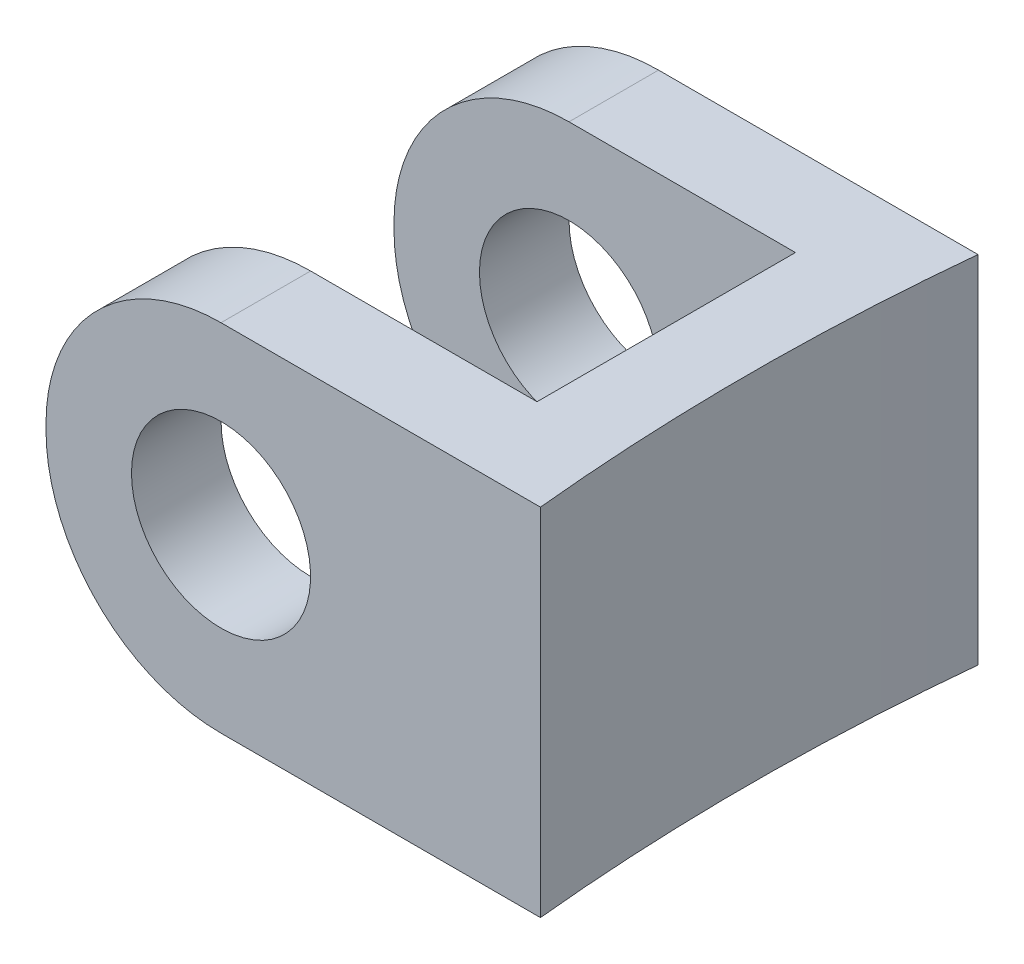
ISO-10303-21;
HEADER;
FILE_DESCRIPTION(('STEP AP214'),'2;1');
FILE_NAME('part.step','',(''),(''),'','','');
FILE_SCHEMA(('AUTOMOTIVE_DESIGN { 1 0 10303 214 1 1 1 1 }'));
ENDSEC;
DATA;
#1=APPLICATION_CONTEXT('core data for automotive mechanical design processes');
#2=APPLICATION_PROTOCOL_DEFINITION('international standard','automotive_design',2000,#1);
#3=PRODUCT_CONTEXT('',#1,'mechanical');
#4=PRODUCT('Part','Part','',(#3));
#5=PRODUCT_RELATED_PRODUCT_CATEGORY('part','',(#4));
#6=PRODUCT_DEFINITION_FORMATION('','',#4);
#7=PRODUCT_DEFINITION_CONTEXT('part definition',#1,'design');
#8=PRODUCT_DEFINITION('design','',#6,#7);
#9=PRODUCT_DEFINITION_SHAPE('','',#8);
#10=(LENGTH_UNIT() NAMED_UNIT(*) SI_UNIT(.MILLI.,.METRE.));
#11=(NAMED_UNIT(*) PLANE_ANGLE_UNIT() SI_UNIT($,.RADIAN.));
#12=(NAMED_UNIT(*) SI_UNIT($,.STERADIAN.) SOLID_ANGLE_UNIT());
#13=UNCERTAINTY_MEASURE_WITH_UNIT(LENGTH_MEASURE(1.E-05),#10,'distance_accuracy_value','');
#14=(GEOMETRIC_REPRESENTATION_CONTEXT(3) GLOBAL_UNCERTAINTY_ASSIGNED_CONTEXT((#13)) GLOBAL_UNIT_ASSIGNED_CONTEXT((#10,
#11,#12)) REPRESENTATION_CONTEXT('',''));
#15=CARTESIAN_POINT('',(0.,0.,0.));
#16=DIRECTION('',(0.,0.,1.));
#17=DIRECTION('',(1.,0.,0.));
#18=AXIS2_PLACEMENT_3D('',#15,#16,#17);
#19=CARTESIAN_POINT('',(0.,8.255,0.));
#20=DIRECTION('',(1.,0.,0.));
#21=DIRECTION('',(0.,0.,-1.));
#22=AXIS2_PLACEMENT_3D('',#19,#20,#21);
#23=PLANE('',#22);
#24=DIRECTION('',(0.,-1.,0.));
#25=VECTOR('',#24,1.);
#26=CARTESIAN_POINT('',(0.,8.255,0.));
#27=LINE('',#26,#25);
#28=CARTESIAN_POINT('',(0.,4.191,0.));
#29=VERTEX_POINT('',#28);
#30=CARTESIAN_POINT('',(0.,4.064,0.));
#31=VERTEX_POINT('',#30);
#32=EDGE_CURVE('E160',#29,#31,#27,.T.);
#33=ORIENTED_EDGE('',*,*,#32,.T.);
#34=DIRECTION('',(0.,0.,1.));
#35=VECTOR('',#34,1.);
#36=CARTESIAN_POINT('',(0.,4.064,0.));
#37=LINE('',#36,#35);
#38=CARTESIAN_POINT('',(0.,4.064,2.07974));
#39=VERTEX_POINT('',#38);
#40=EDGE_CURVE('E211',#31,#39,#37,.T.);
#41=ORIENTED_EDGE('',*,*,#40,.T.);
#42=DIRECTION('',(0.,-1.,0.));
#43=VECTOR('',#42,1.);
#44=CARTESIAN_POINT('',(0.,8.255,2.07974));
#45=LINE('',#44,#43);
#46=CARTESIAN_POINT('',(0.,4.191,2.07974));
#47=VERTEX_POINT('',#46);
#48=EDGE_CURVE('E143',#47,#39,#45,.T.);
#49=ORIENTED_EDGE('',*,*,#48,.F.);
#50=DIRECTION('',(0.,0.,1.));
#51=VECTOR('',#50,1.);
#52=CARTESIAN_POINT('',(0.,4.191,0.));
#53=LINE('',#52,#51);
#54=EDGE_CURVE('E53',#47,#29,#53,.F.);
#55=ORIENTED_EDGE('',*,*,#54,.T.);
#56=EDGE_LOOP('',(#33,#41,#49,#55));
#57=FACE_BOUND('',#56,.T.);
#58=ADVANCED_FACE('F33',(#57),#23,.F.);
#59=CARTESIAN_POINT('',(9.3218,8.255,2.07974));
#60=DIRECTION('',(0.,0.,-1.));
#61=DIRECTION('',(-1.,0.,0.));
#62=AXIS2_PLACEMENT_3D('',#59,#60,#61);
#63=PLANE('',#62);
#64=CARTESIAN_POINT('',(4.064,4.191,2.07974));
#65=DIRECTION('',(0.,0.,-1.));
#66=DIRECTION('',(-1.,0.,0.));
#67=AXIS2_PLACEMENT_3D('',#64,#65,#66);
#68=CIRCLE('',#67,2.07899);
#69=CARTESIAN_POINT('',(1.98501,4.191,2.07974));
#70=VERTEX_POINT('',#69);
#71=EDGE_CURVE('E163',#70,#70,#68,.T.);
#72=ORIENTED_EDGE('',*,*,#71,.T.);
#73=EDGE_LOOP('',(#72));
#74=FACE_BOUND('',#73,.T.);
#75=ORIENTED_EDGE('',*,*,#48,.T.);
#76=CARTESIAN_POINT('',(4.064,4.064,2.07974));
#77=DIRECTION('',(0.,0.,-1.));
#78=DIRECTION('',(-1.,0.,0.));
#79=AXIS2_PLACEMENT_3D('',#76,#77,#78);
#80=CIRCLE('',#79,4.064);
#81=CARTESIAN_POINT('',(4.064,0.,2.07974));
#82=VERTEX_POINT('',#81);
#83=EDGE_CURVE('E216',#39,#82,#80,.F.);
#84=ORIENTED_EDGE('',*,*,#83,.T.);
#85=DIRECTION('',(1.,0.,0.));
#86=VECTOR('',#85,1.);
#87=CARTESIAN_POINT('',(9.3218,0.,2.07974));
#88=LINE('',#87,#86);
#89=CARTESIAN_POINT('',(9.3218,0.,2.07974));
#90=VERTEX_POINT('',#89);
#91=EDGE_CURVE('E140',#82,#90,#88,.T.);
#92=ORIENTED_EDGE('',*,*,#91,.T.);
#93=DIRECTION('',(0.,-1.,0.));
#94=VECTOR('',#93,1.);
#95=CARTESIAN_POINT('',(9.3218,8.255,2.07974));
#96=LINE('',#95,#94);
#97=CARTESIAN_POINT('',(9.3218,8.255,2.07974));
#98=VERTEX_POINT('',#97);
#99=EDGE_CURVE('E136',#98,#90,#96,.T.);
#100=ORIENTED_EDGE('',*,*,#99,.F.);
#101=DIRECTION('',(1.,0.,0.));
#102=VECTOR('',#101,1.);
#103=CARTESIAN_POINT('',(9.3218,8.255,2.07974));
#104=LINE('',#103,#102);
#105=CARTESIAN_POINT('',(4.064,8.255,2.07974));
#106=VERTEX_POINT('',#105);
#107=EDGE_CURVE('E122',#106,#98,#104,.T.);
#108=ORIENTED_EDGE('',*,*,#107,.F.);
#109=CARTESIAN_POINT('',(4.064,4.191,2.07974));
#110=DIRECTION('',(0.,0.,-1.));
#111=DIRECTION('',(-1.,0.,0.));
#112=AXIS2_PLACEMENT_3D('',#109,#110,#111);
#113=CIRCLE('',#112,4.064);
#114=EDGE_CURVE('E214',#106,#47,#113,.F.);
#115=ORIENTED_EDGE('',*,*,#114,.T.);
#116=EDGE_LOOP('',(#75,#84,#92,#100,#108,#115));
#117=FACE_BOUND('',#116,.T.);
#118=ADVANCED_FACE('F138',(#74,#117),#63,.F.);
#119=CARTESIAN_POINT('',(9.3218,8.255,5.08));
#120=DIRECTION('',(1.,0.,0.));
#121=DIRECTION('',(0.,0.,-1.));
#122=AXIS2_PLACEMENT_3D('',#119,#120,#121);
#123=PLANE('',#122);
#124=DIRECTION('',(0.,0.,1.));
#125=VECTOR('',#124,1.);
#126=CARTESIAN_POINT('',(9.3218,0.,5.08));
#127=LINE('',#126,#125);
#128=CARTESIAN_POINT('',(9.3218,0.,8.07974));
#129=VERTEX_POINT('',#128);
#130=EDGE_CURVE('E162',#90,#129,#127,.T.);
#131=ORIENTED_EDGE('',*,*,#130,.T.);
#132=DIRECTION('',(0.,-1.,0.));
#133=VECTOR('',#132,1.);
#134=CARTESIAN_POINT('',(9.3218,8.255,8.07974));
#135=LINE('',#134,#133);
#136=CARTESIAN_POINT('',(9.3218,8.255,8.07974));
#137=VERTEX_POINT('',#136);
#138=EDGE_CURVE('E144',#137,#129,#135,.T.);
#139=ORIENTED_EDGE('',*,*,#138,.F.);
#140=DIRECTION('',(0.,0.,1.));
#141=VECTOR('',#140,1.);
#142=CARTESIAN_POINT('',(9.3218,8.255,5.08));
#143=LINE('',#142,#141);
#144=EDGE_CURVE('E127',#98,#137,#143,.T.);
#145=ORIENTED_EDGE('',*,*,#144,.F.);
#146=ORIENTED_EDGE('',*,*,#99,.T.);
#147=EDGE_LOOP('',(#131,#139,#145,#146));
#148=FACE_BOUND('',#147,.T.);
#149=ADVANCED_FACE('F146',(#148),#123,.F.);
#150=CARTESIAN_POINT('',(9.3218,8.255,8.07974));
#151=DIRECTION('',(0.,0.,1.));
#152=DIRECTION('',(1.,0.,0.));
#153=AXIS2_PLACEMENT_3D('',#150,#151,#152);
#154=PLANE('',#153);
#155=CARTESIAN_POINT('',(4.064,4.191,8.07974));
#156=DIRECTION('',(0.,0.,1.));
#157=DIRECTION('',(1.,0.,0.));
#158=AXIS2_PLACEMENT_3D('',#155,#156,#157);
#159=CIRCLE('',#158,2.07899);
#160=CARTESIAN_POINT('',(6.14299,4.191,8.07974));
#161=VERTEX_POINT('',#160);
#162=EDGE_CURVE('E400',#161,#161,#159,.T.);
#163=ORIENTED_EDGE('',*,*,#162,.T.);
#164=EDGE_LOOP('',(#163));
#165=FACE_BOUND('',#164,.T.);
#166=DIRECTION('',(-1.,0.,0.));
#167=VECTOR('',#166,1.);
#168=CARTESIAN_POINT('',(9.3218,0.,8.07974));
#169=LINE('',#168,#167);
#170=CARTESIAN_POINT('',(4.064,0.,8.07974));
#171=VERTEX_POINT('',#170);
#172=EDGE_CURVE('E165',#129,#171,#169,.T.);
#173=ORIENTED_EDGE('',*,*,#172,.T.);
#174=CARTESIAN_POINT('',(4.064,4.064,8.07974));
#175=DIRECTION('',(0.,0.,1.));
#176=DIRECTION('',(1.,0.,0.));
#177=AXIS2_PLACEMENT_3D('',#174,#175,#176);
#178=CIRCLE('',#177,4.064);
#179=CARTESIAN_POINT('',(0.,4.064,8.07974));
#180=VERTEX_POINT('',#179);
#181=EDGE_CURVE('E204',#171,#180,#178,.F.);
#182=ORIENTED_EDGE('',*,*,#181,.T.);
#183=DIRECTION('',(0.,-1.,0.));
#184=VECTOR('',#183,1.);
#185=CARTESIAN_POINT('',(0.,8.255,8.07974));
#186=LINE('',#185,#184);
#187=CARTESIAN_POINT('',(0.,4.191,8.07974));
#188=VERTEX_POINT('',#187);
#189=EDGE_CURVE('E184',#188,#180,#186,.T.);
#190=ORIENTED_EDGE('',*,*,#189,.F.);
#191=CARTESIAN_POINT('',(4.064,4.191,8.07974));
#192=DIRECTION('',(0.,0.,1.));
#193=DIRECTION('',(1.,0.,0.));
#194=AXIS2_PLACEMENT_3D('',#191,#192,#193);
#195=CIRCLE('',#194,4.064);
#196=CARTESIAN_POINT('',(4.064,8.255,8.07974));
#197=VERTEX_POINT('',#196);
#198=EDGE_CURVE('E202',#188,#197,#195,.F.);
#199=ORIENTED_EDGE('',*,*,#198,.T.);
#200=DIRECTION('',(-1.,0.,0.));
#201=VECTOR('',#200,1.);
#202=CARTESIAN_POINT('',(9.3218,8.255,8.07974));
#203=LINE('',#202,#201);
#204=EDGE_CURVE('E149',#137,#197,#203,.T.);
#205=ORIENTED_EDGE('',*,*,#204,.F.);
#206=ORIENTED_EDGE('',*,*,#138,.T.);
#207=EDGE_LOOP('',(#173,#182,#190,#199,#205,#206));
#208=FACE_BOUND('',#207,.T.);
#209=ADVANCED_FACE('F232',(#165,#208),#154,.F.);
#210=CARTESIAN_POINT('',(0.,8.255,8.07974));
#211=DIRECTION('',(1.,0.,0.));
#212=DIRECTION('',(0.,0.,-1.));
#213=AXIS2_PLACEMENT_3D('',#210,#211,#212);
#214=PLANE('',#213);
#215=ORIENTED_EDGE('',*,*,#189,.T.);
#216=DIRECTION('',(0.,0.,1.));
#217=VECTOR('',#216,1.);
#218=CARTESIAN_POINT('',(0.,4.064,8.07974));
#219=LINE('',#218,#217);
#220=CARTESIAN_POINT('',(0.,4.064,10.16));
#221=VERTEX_POINT('',#220);
#222=EDGE_CURVE('E191',#180,#221,#219,.T.);
#223=ORIENTED_EDGE('',*,*,#222,.T.);
#224=DIRECTION('',(0.,-1.,0.));
#225=VECTOR('',#224,1.);
#226=CARTESIAN_POINT('',(0.,8.255,10.16));
#227=LINE('',#226,#225);
#228=CARTESIAN_POINT('',(0.,4.191,10.16));
#229=VERTEX_POINT('',#228);
#230=EDGE_CURVE('E181',#229,#221,#227,.T.);
#231=ORIENTED_EDGE('',*,*,#230,.F.);
#232=DIRECTION('',(0.,0.,1.));
#233=VECTOR('',#232,1.);
#234=CARTESIAN_POINT('',(0.,4.191,8.07974));
#235=LINE('',#234,#233);
#236=EDGE_CURVE('E189',#229,#188,#235,.F.);
#237=ORIENTED_EDGE('',*,*,#236,.T.);
#238=EDGE_LOOP('',(#215,#223,#231,#237));
#239=FACE_BOUND('',#238,.T.);
#240=ADVANCED_FACE('F246',(#239),#214,.F.);
#241=CARTESIAN_POINT('',(11.2268,8.255,10.16));
#242=DIRECTION('',(0.,0.,-1.));
#243=DIRECTION('',(-1.,0.,0.));
#244=AXIS2_PLACEMENT_3D('',#241,#242,#243);
#245=PLANE('',#244);
#246=CARTESIAN_POINT('',(4.064,4.191,10.16));
#247=DIRECTION('',(0.,0.,-1.));
#248=DIRECTION('',(-1.,0.,0.));
#249=AXIS2_PLACEMENT_3D('',#246,#247,#248);
#250=CIRCLE('',#249,2.07899);
#251=CARTESIAN_POINT('',(1.98501,4.191,10.16));
#252=VERTEX_POINT('',#251);
#253=EDGE_CURVE('E402',#252,#252,#250,.T.);
#254=ORIENTED_EDGE('',*,*,#253,.T.);
#255=EDGE_LOOP('',(#254));
#256=FACE_BOUND('',#255,.T.);
#257=ORIENTED_EDGE('',*,*,#230,.T.);
#258=CARTESIAN_POINT('',(4.064,4.064,10.16));
#259=DIRECTION('',(0.,0.,-1.));
#260=DIRECTION('',(-1.,0.,0.));
#261=AXIS2_PLACEMENT_3D('',#258,#259,#260);
#262=CIRCLE('',#261,4.064);
#263=CARTESIAN_POINT('',(4.064,0.,10.16));
#264=VERTEX_POINT('',#263);
#265=EDGE_CURVE('E196',#221,#264,#262,.F.);
#266=ORIENTED_EDGE('',*,*,#265,.T.);
#267=DIRECTION('',(1.,0.,0.));
#268=VECTOR('',#267,1.);
#269=CARTESIAN_POINT('',(11.2268,0.,10.16));
#270=LINE('',#269,#268);
#271=CARTESIAN_POINT('',(11.4814381949837,0.,10.16));
#272=VERTEX_POINT('',#271);
#273=EDGE_CURVE('E168',#264,#272,#270,.T.);
#274=ORIENTED_EDGE('',*,*,#273,.T.);
#275=DIRECTION('',(0.,-1.,0.));
#276=VECTOR('',#275,1.);
#277=CARTESIAN_POINT('',(11.4814381949837,8.255,10.16));
#278=LINE('',#277,#276);
#279=CARTESIAN_POINT('',(11.4814381949837,8.255,10.16));
#280=VERTEX_POINT('',#279);
#281=EDGE_CURVE('E178',#280,#272,#278,.T.);
#282=ORIENTED_EDGE('',*,*,#281,.F.);
#283=DIRECTION('',(1.,0.,0.));
#284=VECTOR('',#283,1.);
#285=CARTESIAN_POINT('',(0.,8.255,10.16));
#286=LINE('',#285,#284);
#287=CARTESIAN_POINT('',(4.064,8.255,10.16));
#288=VERTEX_POINT('',#287);
#289=EDGE_CURVE('E151',#288,#280,#286,.T.);
#290=ORIENTED_EDGE('',*,*,#289,.F.);
#291=CARTESIAN_POINT('',(4.064,4.191,10.16));
#292=DIRECTION('',(0.,0.,-1.));
#293=DIRECTION('',(-1.,0.,0.));
#294=AXIS2_PLACEMENT_3D('',#291,#292,#293);
#295=CIRCLE('',#294,4.064);
#296=EDGE_CURVE('E194',#288,#229,#295,.F.);
#297=ORIENTED_EDGE('',*,*,#296,.T.);
#298=EDGE_LOOP('',(#257,#266,#274,#282,#290,#297));
#299=FACE_BOUND('',#298,.T.);
#300=ADVANCED_FACE('F243',(#256,#299),#245,.F.);
#301=CARTESIAN_POINT('',(62.0268,8.255,5.08));
#302=DIRECTION('',(0.,-1.,0.));
#303=DIRECTION('',(0.,0.,-1.));
#304=AXIS2_PLACEMENT_3D('',#301,#302,#303);
#305=CYLINDRICAL_SURFACE('',#304,50.8);
#306=CARTESIAN_POINT('',(62.0268,0.,5.08));
#307=DIRECTION('',(0.,-1.,0.));
#308=DIRECTION('',(0.,0.,1.));
#309=AXIS2_PLACEMENT_3D('',#306,#307,#308);
#310=CIRCLE('',#309,50.8);
#311=CARTESIAN_POINT('',(11.4814381949837,0.,0.));
#312=VERTEX_POINT('',#311);
#313=EDGE_CURVE('E170',#272,#312,#310,.T.);
#314=ORIENTED_EDGE('',*,*,#313,.T.);
#315=DIRECTION('',(0.,-1.,0.));
#316=VECTOR('',#315,1.);
#317=CARTESIAN_POINT('',(11.4814381949837,8.255,0.));
#318=LINE('',#317,#316);
#319=CARTESIAN_POINT('',(11.4814381949837,8.255,0.));
#320=VERTEX_POINT('',#319);
#321=EDGE_CURVE('E175',#320,#312,#318,.T.);
#322=ORIENTED_EDGE('',*,*,#321,.F.);
#323=CARTESIAN_POINT('',(62.0268,8.255,5.08));
#324=DIRECTION('',(0.,-1.,0.));
#325=DIRECTION('',(0.,0.,1.));
#326=AXIS2_PLACEMENT_3D('',#323,#324,#325);
#327=CIRCLE('',#326,50.8);
#328=EDGE_CURVE('E156',#280,#320,#327,.T.);
#329=ORIENTED_EDGE('',*,*,#328,.F.);
#330=ORIENTED_EDGE('',*,*,#281,.T.);
#331=EDGE_LOOP('',(#314,#322,#329,#330));
#332=FACE_BOUND('',#331,.T.);
#333=ADVANCED_FACE('F253',(#332),#305,.F.);
#334=CARTESIAN_POINT('',(0.,8.255,0.));
#335=DIRECTION('',(0.,0.,1.));
#336=DIRECTION('',(1.,0.,0.));
#337=AXIS2_PLACEMENT_3D('',#334,#335,#336);
#338=PLANE('',#337);
#339=CARTESIAN_POINT('',(4.064,4.191,0.));
#340=DIRECTION('',(0.,0.,-1.));
#341=DIRECTION('',(-1.,0.,0.));
#342=AXIS2_PLACEMENT_3D('',#339,#340,#341);
#343=CIRCLE('',#342,2.07899);
#344=CARTESIAN_POINT('',(1.98501,4.191,0.));
#345=VERTEX_POINT('',#344);
#346=EDGE_CURVE('E406',#345,#345,#343,.T.);
#347=ORIENTED_EDGE('',*,*,#346,.F.);
#348=EDGE_LOOP('',(#347));
#349=FACE_BOUND('',#348,.T.);
#350=DIRECTION('',(-1.,0.,0.));
#351=VECTOR('',#350,1.);
#352=CARTESIAN_POINT('',(0.,0.,0.));
#353=LINE('',#352,#351);
#354=CARTESIAN_POINT('',(4.064,0.,0.));
#355=VERTEX_POINT('',#354);
#356=EDGE_CURVE('E133',#312,#355,#353,.T.);
#357=ORIENTED_EDGE('',*,*,#356,.T.);
#358=CARTESIAN_POINT('',(4.064,4.064,0.));
#359=DIRECTION('',(0.,0.,1.));
#360=DIRECTION('',(1.,0.,0.));
#361=AXIS2_PLACEMENT_3D('',#358,#359,#360);
#362=CIRCLE('',#361,4.064);
#363=EDGE_CURVE('E11',#355,#31,#362,.F.);
#364=ORIENTED_EDGE('',*,*,#363,.T.);
#365=ORIENTED_EDGE('',*,*,#32,.F.);
#366=CARTESIAN_POINT('',(4.064,4.191,0.));
#367=DIRECTION('',(0.,0.,1.));
#368=DIRECTION('',(1.,0.,0.));
#369=AXIS2_PLACEMENT_3D('',#366,#367,#368);
#370=CIRCLE('',#369,4.064);
#371=CARTESIAN_POINT('',(4.064,8.255,0.));
#372=VERTEX_POINT('',#371);
#373=EDGE_CURVE('E41',#29,#372,#370,.F.);
#374=ORIENTED_EDGE('',*,*,#373,.T.);
#375=DIRECTION('',(-1.,0.,0.));
#376=VECTOR('',#375,1.);
#377=CARTESIAN_POINT('',(11.2268,8.255,0.));
#378=LINE('',#377,#376);
#379=EDGE_CURVE('E158',#320,#372,#378,.T.);
#380=ORIENTED_EDGE('',*,*,#379,.F.);
#381=ORIENTED_EDGE('',*,*,#321,.T.);
#382=EDGE_LOOP('',(#357,#364,#365,#374,#380,#381));
#383=FACE_BOUND('',#382,.T.);
#384=ADVANCED_FACE('F219',(#349,#383),#338,.F.);
#385=CARTESIAN_POINT('',(62.0268,8.255,5.08));
#386=DIRECTION('',(0.,1.,0.));
#387=DIRECTION('',(0.,0.,1.));
#388=AXIS2_PLACEMENT_3D('',#385,#386,#387);
#389=PLANE('',#388);
#390=ORIENTED_EDGE('',*,*,#204,.T.);
#391=DIRECTION('',(0.,0.,1.));
#392=VECTOR('',#391,1.);
#393=CARTESIAN_POINT('',(4.064,8.255,10.16));
#394=LINE('',#393,#392);
#395=EDGE_CURVE('E207',#197,#288,#394,.T.);
#396=ORIENTED_EDGE('',*,*,#395,.T.);
#397=ORIENTED_EDGE('',*,*,#289,.T.);
#398=ORIENTED_EDGE('',*,*,#328,.T.);
#399=ORIENTED_EDGE('',*,*,#379,.T.);
#400=DIRECTION('',(0.,0.,1.));
#401=VECTOR('',#400,1.);
#402=CARTESIAN_POINT('',(4.064,8.255,2.07974));
#403=LINE('',#402,#401);
#404=EDGE_CURVE('E131',#372,#106,#403,.T.);
#405=ORIENTED_EDGE('',*,*,#404,.T.);
#406=ORIENTED_EDGE('',*,*,#107,.T.);
#407=ORIENTED_EDGE('',*,*,#144,.T.);
#408=EDGE_LOOP('',(#390,#396,#397,#398,#399,#405,#406,#407));
#409=FACE_BOUND('',#408,.T.);
#410=ADVANCED_FACE('F125',(#409),#389,.T.);
#411=CARTESIAN_POINT('',(62.0268,0.,5.08));
#412=DIRECTION('',(0.,1.,0.));
#413=DIRECTION('',(0.,0.,1.));
#414=AXIS2_PLACEMENT_3D('',#411,#412,#413);
#415=PLANE('',#414);
#416=ORIENTED_EDGE('',*,*,#273,.F.);
#417=DIRECTION('',(0.,0.,1.));
#418=VECTOR('',#417,1.);
#419=CARTESIAN_POINT('',(4.064,0.,5.08000000000001));
#420=LINE('',#419,#418);
#421=EDGE_CURVE('E200',#264,#171,#420,.F.);
#422=ORIENTED_EDGE('',*,*,#421,.T.);
#423=ORIENTED_EDGE('',*,*,#172,.F.);
#424=ORIENTED_EDGE('',*,*,#130,.F.);
#425=ORIENTED_EDGE('',*,*,#91,.F.);
#426=DIRECTION('',(0.,0.,1.));
#427=VECTOR('',#426,1.);
#428=CARTESIAN_POINT('',(4.064,0.,5.08));
#429=LINE('',#428,#427);
#430=EDGE_CURVE('E198',#82,#355,#429,.F.);
#431=ORIENTED_EDGE('',*,*,#430,.T.);
#432=ORIENTED_EDGE('',*,*,#356,.F.);
#433=ORIENTED_EDGE('',*,*,#313,.F.);
#434=EDGE_LOOP('',(#416,#422,#423,#424,#425,#431,#432,#433));
#435=FACE_BOUND('',#434,.T.);
#436=ADVANCED_FACE('F229',(#435),#415,.F.);
#437=CARTESIAN_POINT('',(4.064,4.064,8.07974));
#438=DIRECTION('',(0.,0.,1.));
#439=DIRECTION('',(1.,0.,0.));
#440=AXIS2_PLACEMENT_3D('',#437,#438,#439);
#441=CYLINDRICAL_SURFACE('',#440,4.064);
#442=ORIENTED_EDGE('',*,*,#181,.F.);
#443=ORIENTED_EDGE('',*,*,#421,.F.);
#444=ORIENTED_EDGE('',*,*,#265,.F.);
#445=ORIENTED_EDGE('',*,*,#222,.F.);
#446=EDGE_LOOP('',(#442,#443,#444,#445));
#447=FACE_BOUND('',#446,.T.);
#448=ADVANCED_FACE('F249',(#447),#441,.T.);
#449=CARTESIAN_POINT('',(4.064,4.191,5.08000000000001));
#450=DIRECTION('',(0.,0.,-1.));
#451=DIRECTION('',(-1.,0.,0.));
#452=AXIS2_PLACEMENT_3D('',#449,#450,#451);
#453=CYLINDRICAL_SURFACE('',#452,4.064);
#454=ORIENTED_EDGE('',*,*,#198,.F.);
#455=ORIENTED_EDGE('',*,*,#236,.F.);
#456=ORIENTED_EDGE('',*,*,#296,.F.);
#457=ORIENTED_EDGE('',*,*,#395,.F.);
#458=EDGE_LOOP('',(#454,#455,#456,#457));
#459=FACE_BOUND('',#458,.T.);
#460=ADVANCED_FACE('F239',(#459),#453,.T.);
#461=CARTESIAN_POINT('',(4.064,4.064,0.));
#462=DIRECTION('',(0.,0.,1.));
#463=DIRECTION('',(1.,0.,0.));
#464=AXIS2_PLACEMENT_3D('',#461,#462,#463);
#465=CYLINDRICAL_SURFACE('',#464,4.064);
#466=ORIENTED_EDGE('',*,*,#363,.F.);
#467=ORIENTED_EDGE('',*,*,#430,.F.);
#468=ORIENTED_EDGE('',*,*,#83,.F.);
#469=ORIENTED_EDGE('',*,*,#40,.F.);
#470=EDGE_LOOP('',(#466,#467,#468,#469));
#471=FACE_BOUND('',#470,.T.);
#472=ADVANCED_FACE('F225',(#471),#465,.T.);
#473=CARTESIAN_POINT('',(4.064,4.191,5.08));
#474=DIRECTION('',(0.,0.,-1.));
#475=DIRECTION('',(-1.,0.,0.));
#476=AXIS2_PLACEMENT_3D('',#473,#474,#475);
#477=CYLINDRICAL_SURFACE('',#476,4.064);
#478=ORIENTED_EDGE('',*,*,#373,.F.);
#479=ORIENTED_EDGE('',*,*,#54,.F.);
#480=ORIENTED_EDGE('',*,*,#114,.F.);
#481=ORIENTED_EDGE('',*,*,#404,.F.);
#482=EDGE_LOOP('',(#478,#479,#480,#481));
#483=FACE_BOUND('',#482,.T.);
#484=ADVANCED_FACE('F35',(#483),#477,.T.);
#485=CARTESIAN_POINT('',(4.064,4.191,10.16));
#486=DIRECTION('',(0.,0.,-1.));
#487=DIRECTION('',(-1.,0.,0.));
#488=AXIS2_PLACEMENT_3D('',#485,#486,#487);
#489=CYLINDRICAL_SURFACE('',#488,2.07899);
#490=ORIENTED_EDGE('',*,*,#346,.T.);
#491=EDGE_LOOP('',(#490));
#492=FACE_BOUND('',#491,.T.);
#493=ORIENTED_EDGE('',*,*,#71,.F.);
#494=EDGE_LOOP('',(#493));
#495=FACE_BOUND('',#494,.T.);
#496=ADVANCED_FACE('F280',(#492,#495),#489,.F.);
#497=ORIENTED_EDGE('',*,*,#253,.F.);
#498=EDGE_LOOP('',(#497));
#499=FACE_BOUND('',#498,.T.);
#500=ORIENTED_EDGE('',*,*,#162,.F.);
#501=EDGE_LOOP('',(#500));
#502=FACE_BOUND('',#501,.T.);
#503=ADVANCED_FACE('F284',(#499,#502),#489,.F.);
#504=CLOSED_SHELL('',(#58,#118,#149,#209,#240,#300,#333,#384,#410,#436,#448,#460,#472,#484,#496,#503));
#505=MANIFOLD_SOLID_BREP('B2',#504);
#506=ADVANCED_BREP_SHAPE_REPRESENTATION('',(#18,#505),#14);
#507=SHAPE_DEFINITION_REPRESENTATION(#9,#506);
ENDSEC;
END-ISO-10303-21;
